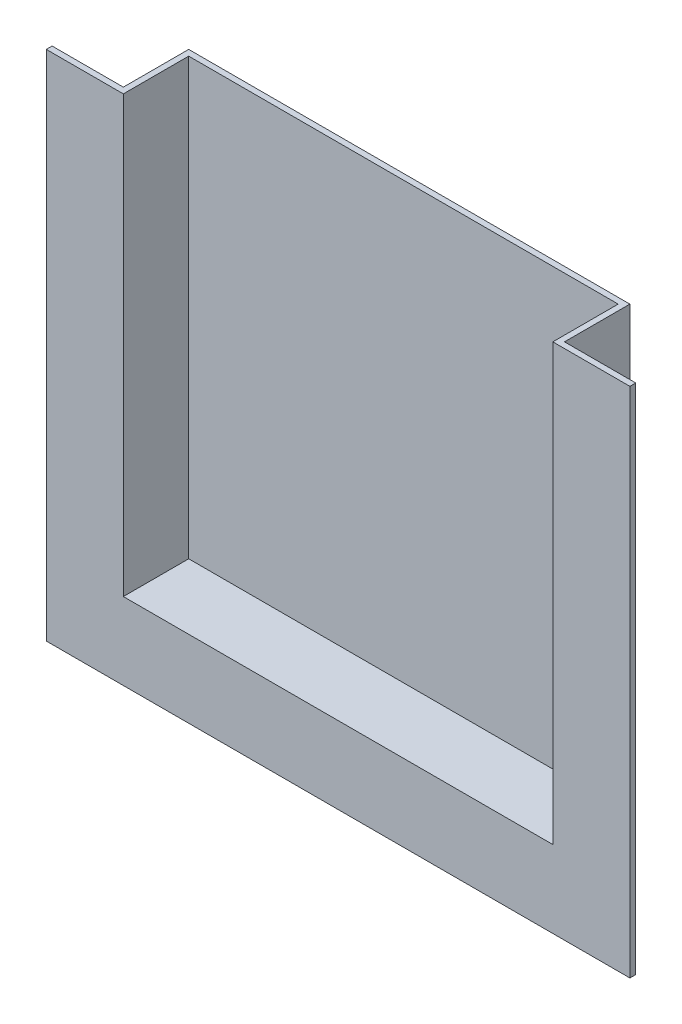
ISO-10303-21;
HEADER;
FILE_DESCRIPTION(('STEP AP214'),'2;1');
FILE_NAME('part.step','',(''),(''),'','','');
FILE_SCHEMA(('AUTOMOTIVE_DESIGN { 1 0 10303 214 1 1 1 1 }'));
ENDSEC;
DATA;
#1=APPLICATION_CONTEXT('core data for automotive mechanical design processes');
#2=APPLICATION_PROTOCOL_DEFINITION('international standard','automotive_design',2000,#1);
#3=PRODUCT_CONTEXT('',#1,'mechanical');
#4=PRODUCT('Part','Part','',(#3));
#5=PRODUCT_RELATED_PRODUCT_CATEGORY('part','',(#4));
#6=PRODUCT_DEFINITION_FORMATION('','',#4);
#7=PRODUCT_DEFINITION_CONTEXT('part definition',#1,'design');
#8=PRODUCT_DEFINITION('design','',#6,#7);
#9=PRODUCT_DEFINITION_SHAPE('','',#8);
#10=(LENGTH_UNIT() NAMED_UNIT(*) SI_UNIT(.MILLI.,.METRE.));
#11=(NAMED_UNIT(*) PLANE_ANGLE_UNIT() SI_UNIT($,.RADIAN.));
#12=(NAMED_UNIT(*) SI_UNIT($,.STERADIAN.) SOLID_ANGLE_UNIT());
#13=UNCERTAINTY_MEASURE_WITH_UNIT(LENGTH_MEASURE(1.E-05),#10,'distance_accuracy_value','');
#14=(GEOMETRIC_REPRESENTATION_CONTEXT(3) GLOBAL_UNCERTAINTY_ASSIGNED_CONTEXT((#13)) GLOBAL_UNIT_ASSIGNED_CONTEXT((#10,
#11,#12)) REPRESENTATION_CONTEXT('',''));
#15=CARTESIAN_POINT('',(0.,0.,0.));
#16=DIRECTION('',(0.,0.,1.));
#17=DIRECTION('',(1.,0.,0.));
#18=AXIS2_PLACEMENT_3D('',#15,#16,#17);
#19=CARTESIAN_POINT('',(0.,0.,15.494));
#20=DIRECTION('',(0.,0.,-1.));
#21=DIRECTION('',(-1.,0.,0.));
#22=AXIS2_PLACEMENT_3D('',#19,#20,#21);
#23=PLANE('',#22);
#24=DIRECTION('',(0.,-1.,0.));
#25=VECTOR('',#24,1.);
#26=CARTESIAN_POINT('',(-46.73,-48.,15.494));
#27=LINE('',#26,#25);
#28=CARTESIAN_POINT('',(-46.73,48.,15.494));
#29=VERTEX_POINT('',#28);
#30=CARTESIAN_POINT('',(-46.73,-46.73,15.494));
#31=VERTEX_POINT('',#30);
#32=EDGE_CURVE('E153',#29,#31,#27,.T.);
#33=ORIENTED_EDGE('',*,*,#32,.F.);
#34=DIRECTION('',(-1.,0.,0.));
#35=VECTOR('',#34,1.);
#36=CARTESIAN_POINT('',(-48.,48.,15.494));
#37=LINE('',#36,#35);
#38=CARTESIAN_POINT('',(-63.5,48.,15.494));
#39=VERTEX_POINT('',#38);
#40=EDGE_CURVE('E204',#29,#39,#37,.T.);
#41=ORIENTED_EDGE('',*,*,#40,.T.);
#42=DIRECTION('',(0.,-1.,0.));
#43=VECTOR('',#42,1.);
#44=CARTESIAN_POINT('',(-63.5,48.,15.494));
#45=LINE('',#44,#43);
#46=CARTESIAN_POINT('',(-63.5,-63.5,15.494));
#47=VERTEX_POINT('',#46);
#48=EDGE_CURVE('E157',#39,#47,#45,.T.);
#49=ORIENTED_EDGE('',*,*,#48,.T.);
#50=DIRECTION('',(1.,0.,0.));
#51=VECTOR('',#50,1.);
#52=CARTESIAN_POINT('',(-63.5,-63.5,15.494));
#53=LINE('',#52,#51);
#54=CARTESIAN_POINT('',(63.5,-63.5,15.494));
#55=VERTEX_POINT('',#54);
#56=EDGE_CURVE('E181',#47,#55,#53,.T.);
#57=ORIENTED_EDGE('',*,*,#56,.T.);
#58=DIRECTION('',(0.,1.,0.));
#59=VECTOR('',#58,1.);
#60=CARTESIAN_POINT('',(63.5,-63.5,15.494));
#61=LINE('',#60,#59);
#62=CARTESIAN_POINT('',(63.5,48.,15.494));
#63=VERTEX_POINT('',#62);
#64=EDGE_CURVE('E184',#55,#63,#61,.T.);
#65=ORIENTED_EDGE('',*,*,#64,.T.);
#66=CARTESIAN_POINT('',(46.73,48.,15.494));
#67=VERTEX_POINT('',#66);
#68=EDGE_CURVE('E201',#63,#67,#37,.T.);
#69=ORIENTED_EDGE('',*,*,#68,.T.);
#70=DIRECTION('',(0.,1.,0.));
#71=VECTOR('',#70,1.);
#72=CARTESIAN_POINT('',(46.73,-48.,15.494));
#73=LINE('',#72,#71);
#74=CARTESIAN_POINT('',(46.73,-46.73,15.494));
#75=VERTEX_POINT('',#74);
#76=EDGE_CURVE('E150',#75,#67,#73,.T.);
#77=ORIENTED_EDGE('',*,*,#76,.F.);
#78=DIRECTION('',(1.,0.,0.));
#79=VECTOR('',#78,1.);
#80=CARTESIAN_POINT('',(-48.,-46.73,15.494));
#81=LINE('',#80,#79);
#82=EDGE_CURVE('E133',#31,#75,#81,.T.);
#83=ORIENTED_EDGE('',*,*,#82,.F.);
#84=EDGE_LOOP('',(#33,#41,#49,#57,#65,#69,#77,#83));
#85=FACE_BOUND('',#84,.T.);
#86=ADVANCED_FACE('F39',(#85),#23,.F.);
#87=CARTESIAN_POINT('',(48.,-48.,15.494));
#88=DIRECTION('',(-1.,0.,0.));
#89=DIRECTION('',(0.,0.,1.));
#90=AXIS2_PLACEMENT_3D('',#87,#88,#89);
#91=PLANE('',#90);
#92=DIRECTION('',(0.,1.,0.));
#93=VECTOR('',#92,1.);
#94=CARTESIAN_POINT('',(48.,-48.,14.224));
#95=LINE('',#94,#93);
#96=CARTESIAN_POINT('',(48.,-48.,14.224));
#97=VERTEX_POINT('',#96);
#98=CARTESIAN_POINT('',(48.,48.,14.224));
#99=VERTEX_POINT('',#98);
#100=EDGE_CURVE('E198',#97,#99,#95,.T.);
#101=ORIENTED_EDGE('',*,*,#100,.F.);
#102=DIRECTION('',(0.,0.,-1.));
#103=VECTOR('',#102,1.);
#104=CARTESIAN_POINT('',(48.,-48.,15.494));
#105=LINE('',#104,#103);
#106=CARTESIAN_POINT('',(48.,-48.,0.));
#107=VERTEX_POINT('',#106);
#108=EDGE_CURVE('E62',#97,#107,#105,.T.);
#109=ORIENTED_EDGE('',*,*,#108,.T.);
#110=DIRECTION('',(0.,1.,0.));
#111=VECTOR('',#110,1.);
#112=CARTESIAN_POINT('',(48.,-48.,0.));
#113=LINE('',#112,#111);
#114=CARTESIAN_POINT('',(48.,48.,0.));
#115=VERTEX_POINT('',#114);
#116=EDGE_CURVE('E200',#107,#115,#113,.T.);
#117=ORIENTED_EDGE('',*,*,#116,.T.);
#118=DIRECTION('',(0.,0.,-1.));
#119=VECTOR('',#118,1.);
#120=CARTESIAN_POINT('',(48.,48.,15.494));
#121=LINE('',#120,#119);
#122=EDGE_CURVE('E47',#99,#115,#121,.T.);
#123=ORIENTED_EDGE('',*,*,#122,.F.);
#124=EDGE_LOOP('',(#101,#109,#117,#123));
#125=FACE_BOUND('',#124,.T.);
#126=ADVANCED_FACE('F41',(#125),#91,.F.);
#127=CARTESIAN_POINT('',(-48.,-48.,15.494));
#128=DIRECTION('',(1.,0.,0.));
#129=DIRECTION('',(0.,0.,-1.));
#130=AXIS2_PLACEMENT_3D('',#127,#128,#129);
#131=PLANE('',#130);
#132=DIRECTION('',(0.,-1.,0.));
#133=VECTOR('',#132,1.);
#134=CARTESIAN_POINT('',(-48.,-48.,14.224));
#135=LINE('',#134,#133);
#136=CARTESIAN_POINT('',(-48.,48.,14.224));
#137=VERTEX_POINT('',#136);
#138=CARTESIAN_POINT('',(-48.,-48.,14.224));
#139=VERTEX_POINT('',#138);
#140=EDGE_CURVE('E190',#137,#139,#135,.T.);
#141=ORIENTED_EDGE('',*,*,#140,.F.);
#142=DIRECTION('',(0.,0.,-1.));
#143=VECTOR('',#142,1.);
#144=CARTESIAN_POINT('',(-48.,48.,15.494));
#145=LINE('',#144,#143);
#146=CARTESIAN_POINT('',(-48.,48.,0.));
#147=VERTEX_POINT('',#146);
#148=EDGE_CURVE('E217',#137,#147,#145,.T.);
#149=ORIENTED_EDGE('',*,*,#148,.T.);
#150=DIRECTION('',(0.,-1.,0.));
#151=VECTOR('',#150,1.);
#152=CARTESIAN_POINT('',(-48.,-48.,0.));
#153=LINE('',#152,#151);
#154=CARTESIAN_POINT('',(-48.,-48.,0.));
#155=VERTEX_POINT('',#154);
#156=EDGE_CURVE('E209',#147,#155,#153,.T.);
#157=ORIENTED_EDGE('',*,*,#156,.T.);
#158=DIRECTION('',(0.,0.,-1.));
#159=VECTOR('',#158,1.);
#160=CARTESIAN_POINT('',(-48.,-48.,15.494));
#161=LINE('',#160,#159);
#162=EDGE_CURVE('E215',#139,#155,#161,.T.);
#163=ORIENTED_EDGE('',*,*,#162,.F.);
#164=EDGE_LOOP('',(#141,#149,#157,#163));
#165=FACE_BOUND('',#164,.T.);
#166=ADVANCED_FACE('F231',(#165),#131,.F.);
#167=CARTESIAN_POINT('',(-48.,-48.,15.494));
#168=DIRECTION('',(0.,1.,0.));
#169=DIRECTION('',(0.,0.,1.));
#170=AXIS2_PLACEMENT_3D('',#167,#168,#169);
#171=PLANE('',#170);
#172=DIRECTION('',(1.,0.,0.));
#173=VECTOR('',#172,1.);
#174=CARTESIAN_POINT('',(-48.,-48.,14.224));
#175=LINE('',#174,#173);
#176=EDGE_CURVE('E11',#139,#97,#175,.T.);
#177=ORIENTED_EDGE('',*,*,#176,.F.);
#178=ORIENTED_EDGE('',*,*,#162,.T.);
#179=DIRECTION('',(1.,0.,0.));
#180=VECTOR('',#179,1.);
#181=CARTESIAN_POINT('',(-48.,-48.,0.));
#182=LINE('',#181,#180);
#183=EDGE_CURVE('E212',#155,#107,#182,.T.);
#184=ORIENTED_EDGE('',*,*,#183,.T.);
#185=ORIENTED_EDGE('',*,*,#108,.F.);
#186=EDGE_LOOP('',(#177,#178,#184,#185));
#187=FACE_BOUND('',#186,.T.);
#188=ADVANCED_FACE('F236',(#187),#171,.F.);
#189=CARTESIAN_POINT('',(-48.,48.,15.494));
#190=DIRECTION('',(0.,-1.,0.));
#191=DIRECTION('',(0.,0.,-1.));
#192=AXIS2_PLACEMENT_3D('',#189,#190,#191);
#193=PLANE('',#192);
#194=ORIENTED_EDGE('',*,*,#40,.F.);
#195=DIRECTION('',(0.,0.,-1.));
#196=VECTOR('',#195,1.);
#197=CARTESIAN_POINT('',(-46.73,48.,15.494));
#198=LINE('',#197,#196);
#199=CARTESIAN_POINT('',(-46.73,48.,1.27));
#200=VERTEX_POINT('',#199);
#201=EDGE_CURVE('E158',#29,#200,#198,.T.);
#202=ORIENTED_EDGE('',*,*,#201,.T.);
#203=DIRECTION('',(-1.,0.,0.));
#204=VECTOR('',#203,1.);
#205=CARTESIAN_POINT('',(0.,48.,1.27));
#206=LINE('',#205,#204);
#207=CARTESIAN_POINT('',(46.73,48.,1.27));
#208=VERTEX_POINT('',#207);
#209=EDGE_CURVE('E149',#208,#200,#206,.T.);
#210=ORIENTED_EDGE('',*,*,#209,.F.);
#211=DIRECTION('',(0.,0.,-1.));
#212=VECTOR('',#211,1.);
#213=CARTESIAN_POINT('',(46.73,48.,15.494));
#214=LINE('',#213,#212);
#215=EDGE_CURVE('E148',#67,#208,#214,.T.);
#216=ORIENTED_EDGE('',*,*,#215,.F.);
#217=ORIENTED_EDGE('',*,*,#68,.F.);
#218=DIRECTION('',(0.,0.,1.));
#219=VECTOR('',#218,1.);
#220=CARTESIAN_POINT('',(63.5,48.,14.224));
#221=LINE('',#220,#219);
#222=CARTESIAN_POINT('',(63.5,48.,14.224));
#223=VERTEX_POINT('',#222);
#224=EDGE_CURVE('E187',#223,#63,#221,.T.);
#225=ORIENTED_EDGE('',*,*,#224,.F.);
#226=DIRECTION('',(-1.,0.,0.));
#227=VECTOR('',#226,1.);
#228=CARTESIAN_POINT('',(-63.5,48.,14.224));
#229=LINE('',#228,#227);
#230=EDGE_CURVE('E165',#223,#99,#229,.T.);
#231=ORIENTED_EDGE('',*,*,#230,.T.);
#232=ORIENTED_EDGE('',*,*,#122,.T.);
#233=DIRECTION('',(-1.,0.,0.));
#234=VECTOR('',#233,1.);
#235=CARTESIAN_POINT('',(-48.,48.,0.));
#236=LINE('',#235,#234);
#237=EDGE_CURVE('E206',#115,#147,#236,.T.);
#238=ORIENTED_EDGE('',*,*,#237,.T.);
#239=ORIENTED_EDGE('',*,*,#148,.F.);
#240=CARTESIAN_POINT('',(-63.5,48.,14.224));
#241=VERTEX_POINT('',#240);
#242=EDGE_CURVE('E169',#137,#241,#229,.T.);
#243=ORIENTED_EDGE('',*,*,#242,.T.);
#244=DIRECTION('',(0.,0.,1.));
#245=VECTOR('',#244,1.);
#246=CARTESIAN_POINT('',(-63.5,48.,14.224));
#247=LINE('',#246,#245);
#248=EDGE_CURVE('E178',#241,#39,#247,.T.);
#249=ORIENTED_EDGE('',*,*,#248,.T.);
#250=EDGE_LOOP('',(#194,#202,#210,#216,#217,#225,#231,#232,#238,#239,#243,#249));
#251=FACE_BOUND('',#250,.T.);
#252=ADVANCED_FACE('F222',(#251),#193,.F.);
#253=CARTESIAN_POINT('',(0.,0.,0.));
#254=DIRECTION('',(0.,0.,-1.));
#255=DIRECTION('',(-1.,0.,0.));
#256=AXIS2_PLACEMENT_3D('',#253,#254,#255);
#257=PLANE('',#256);
#258=ORIENTED_EDGE('',*,*,#116,.F.);
#259=ORIENTED_EDGE('',*,*,#183,.F.);
#260=ORIENTED_EDGE('',*,*,#156,.F.);
#261=ORIENTED_EDGE('',*,*,#237,.F.);
#262=EDGE_LOOP('',(#258,#259,#260,#261));
#263=FACE_BOUND('',#262,.T.);
#264=ADVANCED_FACE('F228',(#263),#257,.T.);
#265=CARTESIAN_POINT('',(0.,0.,14.224));
#266=DIRECTION('',(0.,0.,1.));
#267=DIRECTION('',(1.,0.,0.));
#268=AXIS2_PLACEMENT_3D('',#265,#266,#267);
#269=PLANE('',#268);
#270=ORIENTED_EDGE('',*,*,#176,.T.);
#271=ORIENTED_EDGE('',*,*,#100,.T.);
#272=ORIENTED_EDGE('',*,*,#230,.F.);
#273=DIRECTION('',(0.,1.,0.));
#274=VECTOR('',#273,1.);
#275=CARTESIAN_POINT('',(63.5,-63.5,14.224));
#276=LINE('',#275,#274);
#277=CARTESIAN_POINT('',(63.5,-63.5,14.224));
#278=VERTEX_POINT('',#277);
#279=EDGE_CURVE('E175',#278,#223,#276,.T.);
#280=ORIENTED_EDGE('',*,*,#279,.F.);
#281=DIRECTION('',(1.,0.,0.));
#282=VECTOR('',#281,1.);
#283=CARTESIAN_POINT('',(-63.5,-63.5,14.224));
#284=LINE('',#283,#282);
#285=CARTESIAN_POINT('',(-63.5,-63.5,14.224));
#286=VERTEX_POINT('',#285);
#287=EDGE_CURVE('E172',#286,#278,#284,.T.);
#288=ORIENTED_EDGE('',*,*,#287,.F.);
#289=DIRECTION('',(0.,-1.,0.));
#290=VECTOR('',#289,1.);
#291=CARTESIAN_POINT('',(-63.5,48.,14.224));
#292=LINE('',#291,#290);
#293=EDGE_CURVE('E168',#241,#286,#292,.T.);
#294=ORIENTED_EDGE('',*,*,#293,.F.);
#295=ORIENTED_EDGE('',*,*,#242,.F.);
#296=ORIENTED_EDGE('',*,*,#140,.T.);
#297=EDGE_LOOP('',(#270,#271,#272,#280,#288,#294,#295,#296));
#298=FACE_BOUND('',#297,.T.);
#299=ADVANCED_FACE('F252',(#298),#269,.F.);
#300=CARTESIAN_POINT('',(63.5,-63.5,14.224));
#301=DIRECTION('',(1.,0.,0.));
#302=DIRECTION('',(0.,0.,-1.));
#303=AXIS2_PLACEMENT_3D('',#300,#301,#302);
#304=PLANE('',#303);
#305=ORIENTED_EDGE('',*,*,#64,.F.);
#306=DIRECTION('',(0.,0.,1.));
#307=VECTOR('',#306,1.);
#308=CARTESIAN_POINT('',(63.5,-63.5,14.224));
#309=LINE('',#308,#307);
#310=EDGE_CURVE('E191',#278,#55,#309,.T.);
#311=ORIENTED_EDGE('',*,*,#310,.F.);
#312=ORIENTED_EDGE('',*,*,#279,.T.);
#313=ORIENTED_EDGE('',*,*,#224,.T.);
#314=EDGE_LOOP('',(#305,#311,#312,#313));
#315=FACE_BOUND('',#314,.T.);
#316=ADVANCED_FACE('F313',(#315),#304,.T.);
#317=CARTESIAN_POINT('',(-63.5,-63.5,14.224));
#318=DIRECTION('',(0.,-1.,0.));
#319=DIRECTION('',(0.,0.,-1.));
#320=AXIS2_PLACEMENT_3D('',#317,#318,#319);
#321=PLANE('',#320);
#322=ORIENTED_EDGE('',*,*,#56,.F.);
#323=DIRECTION('',(0.,0.,1.));
#324=VECTOR('',#323,1.);
#325=CARTESIAN_POINT('',(-63.5,-63.5,14.224));
#326=LINE('',#325,#324);
#327=EDGE_CURVE('E193',#286,#47,#326,.T.);
#328=ORIENTED_EDGE('',*,*,#327,.F.);
#329=ORIENTED_EDGE('',*,*,#287,.T.);
#330=ORIENTED_EDGE('',*,*,#310,.T.);
#331=EDGE_LOOP('',(#322,#328,#329,#330));
#332=FACE_BOUND('',#331,.T.);
#333=ADVANCED_FACE('F305',(#332),#321,.T.);
#334=CARTESIAN_POINT('',(-63.5,48.,14.224));
#335=DIRECTION('',(-1.,0.,0.));
#336=DIRECTION('',(0.,0.,1.));
#337=AXIS2_PLACEMENT_3D('',#334,#335,#336);
#338=PLANE('',#337);
#339=ORIENTED_EDGE('',*,*,#48,.F.);
#340=ORIENTED_EDGE('',*,*,#248,.F.);
#341=ORIENTED_EDGE('',*,*,#293,.T.);
#342=ORIENTED_EDGE('',*,*,#327,.T.);
#343=EDGE_LOOP('',(#339,#340,#341,#342));
#344=FACE_BOUND('',#343,.T.);
#345=ADVANCED_FACE('F249',(#344),#338,.T.);
#346=CARTESIAN_POINT('',(46.73,-48.,15.494));
#347=DIRECTION('',(-1.,0.,0.));
#348=DIRECTION('',(0.,0.,1.));
#349=AXIS2_PLACEMENT_3D('',#346,#347,#348);
#350=PLANE('',#349);
#351=ORIENTED_EDGE('',*,*,#76,.T.);
#352=ORIENTED_EDGE('',*,*,#215,.T.);
#353=DIRECTION('',(0.,1.,0.));
#354=VECTOR('',#353,1.);
#355=CARTESIAN_POINT('',(46.73,0.,1.27));
#356=LINE('',#355,#354);
#357=CARTESIAN_POINT('',(46.73,-46.73,1.27));
#358=VERTEX_POINT('',#357);
#359=EDGE_CURVE('E141',#358,#208,#356,.T.);
#360=ORIENTED_EDGE('',*,*,#359,.F.);
#361=DIRECTION('',(0.,0.,-1.));
#362=VECTOR('',#361,1.);
#363=CARTESIAN_POINT('',(46.73,-46.73,15.494));
#364=LINE('',#363,#362);
#365=EDGE_CURVE('E54',#75,#358,#364,.T.);
#366=ORIENTED_EDGE('',*,*,#365,.F.);
#367=EDGE_LOOP('',(#351,#352,#360,#366));
#368=FACE_BOUND('',#367,.T.);
#369=ADVANCED_FACE('F146',(#368),#350,.T.);
#370=CARTESIAN_POINT('',(-46.73,-48.,15.494));
#371=DIRECTION('',(1.,0.,0.));
#372=DIRECTION('',(0.,0.,-1.));
#373=AXIS2_PLACEMENT_3D('',#370,#371,#372);
#374=PLANE('',#373);
#375=ORIENTED_EDGE('',*,*,#32,.T.);
#376=DIRECTION('',(0.,0.,-1.));
#377=VECTOR('',#376,1.);
#378=CARTESIAN_POINT('',(-46.73,-46.73,15.494));
#379=LINE('',#378,#377);
#380=CARTESIAN_POINT('',(-46.73,-46.73,1.27));
#381=VERTEX_POINT('',#380);
#382=EDGE_CURVE('E135',#31,#381,#379,.T.);
#383=ORIENTED_EDGE('',*,*,#382,.T.);
#384=DIRECTION('',(0.,-1.,0.));
#385=VECTOR('',#384,1.);
#386=CARTESIAN_POINT('',(-46.73,0.,1.27));
#387=LINE('',#386,#385);
#388=EDGE_CURVE('E144',#200,#381,#387,.T.);
#389=ORIENTED_EDGE('',*,*,#388,.F.);
#390=ORIENTED_EDGE('',*,*,#201,.F.);
#391=EDGE_LOOP('',(#375,#383,#389,#390));
#392=FACE_BOUND('',#391,.T.);
#393=ADVANCED_FACE('F266',(#392),#374,.T.);
#394=CARTESIAN_POINT('',(-48.,-46.73,15.494));
#395=DIRECTION('',(0.,1.,0.));
#396=DIRECTION('',(0.,0.,1.));
#397=AXIS2_PLACEMENT_3D('',#394,#395,#396);
#398=PLANE('',#397);
#399=ORIENTED_EDGE('',*,*,#82,.T.);
#400=ORIENTED_EDGE('',*,*,#365,.T.);
#401=DIRECTION('',(1.,0.,0.));
#402=VECTOR('',#401,1.);
#403=CARTESIAN_POINT('',(0.,-46.73,1.27));
#404=LINE('',#403,#402);
#405=EDGE_CURVE('E131',#381,#358,#404,.T.);
#406=ORIENTED_EDGE('',*,*,#405,.F.);
#407=ORIENTED_EDGE('',*,*,#382,.F.);
#408=EDGE_LOOP('',(#399,#400,#406,#407));
#409=FACE_BOUND('',#408,.T.);
#410=ADVANCED_FACE('F129',(#409),#398,.T.);
#411=CARTESIAN_POINT('',(0.,0.,1.27));
#412=DIRECTION('',(0.,0.,-1.));
#413=DIRECTION('',(-1.,0.,0.));
#414=AXIS2_PLACEMENT_3D('',#411,#412,#413);
#415=PLANE('',#414);
#416=ORIENTED_EDGE('',*,*,#359,.T.);
#417=ORIENTED_EDGE('',*,*,#209,.T.);
#418=ORIENTED_EDGE('',*,*,#388,.T.);
#419=ORIENTED_EDGE('',*,*,#405,.T.);
#420=EDGE_LOOP('',(#416,#417,#418,#419));
#421=FACE_BOUND('',#420,.T.);
#422=ADVANCED_FACE('F140',(#421),#415,.F.);
#423=CLOSED_SHELL('',(#86,#126,#166,#188,#252,#264,#299,#316,#333,#345,#369,#393,#410,#422));
#424=MANIFOLD_SOLID_BREP('B2',#423);
#425=ADVANCED_BREP_SHAPE_REPRESENTATION('',(#18,#424),#14);
#426=SHAPE_DEFINITION_REPRESENTATION(#9,#425);
ENDSEC;
END-ISO-10303-21;
